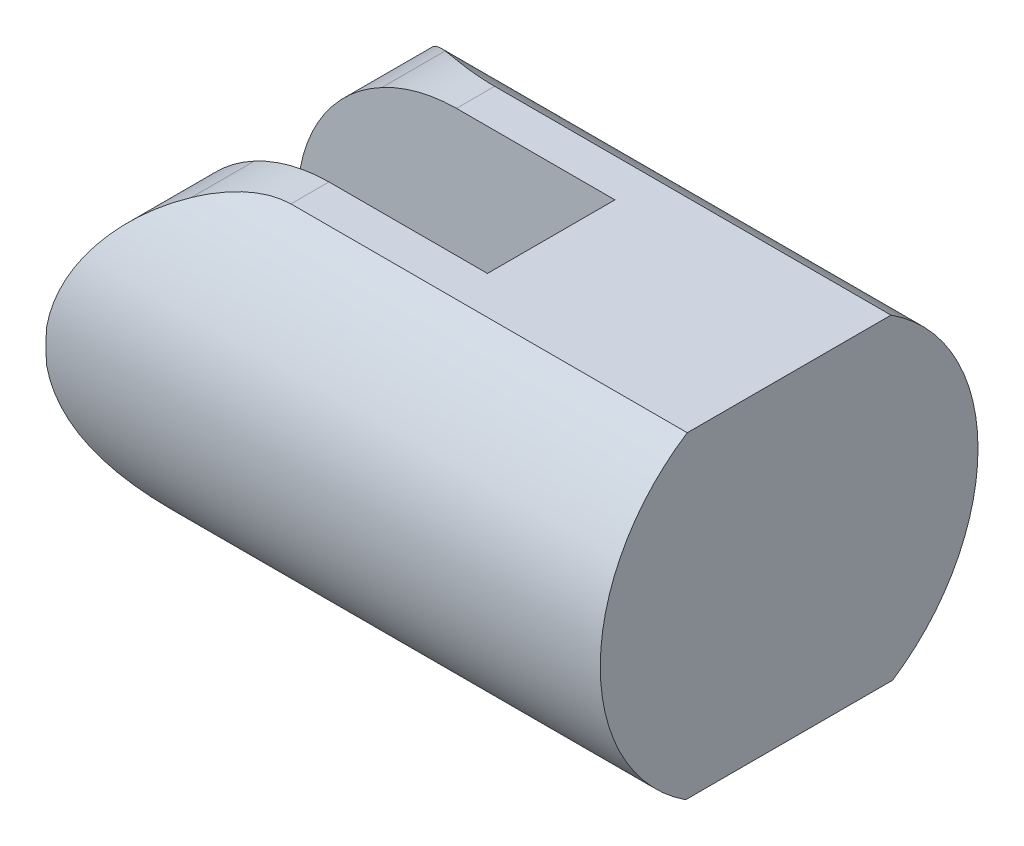
ISO-10303-21;
HEADER;
FILE_DESCRIPTION(('STEP AP214'),'2;1');
FILE_NAME('part.step','',(''),(''),'','','');
FILE_SCHEMA(('AUTOMOTIVE_DESIGN { 1 0 10303 214 1 1 1 1 }'));
ENDSEC;
DATA;
#1=APPLICATION_CONTEXT('core data for automotive mechanical design processes');
#2=APPLICATION_PROTOCOL_DEFINITION('international standard','automotive_design',2000,#1);
#3=PRODUCT_CONTEXT('',#1,'mechanical');
#4=PRODUCT('Part','Part','',(#3));
#5=PRODUCT_RELATED_PRODUCT_CATEGORY('part','',(#4));
#6=PRODUCT_DEFINITION_FORMATION('','',#4);
#7=PRODUCT_DEFINITION_CONTEXT('part definition',#1,'design');
#8=PRODUCT_DEFINITION('design','',#6,#7);
#9=PRODUCT_DEFINITION_SHAPE('','',#8);
#10=(LENGTH_UNIT() NAMED_UNIT(*) SI_UNIT(.MILLI.,.METRE.));
#11=(NAMED_UNIT(*) PLANE_ANGLE_UNIT() SI_UNIT($,.RADIAN.));
#12=(NAMED_UNIT(*) SI_UNIT($,.STERADIAN.) SOLID_ANGLE_UNIT());
#13=UNCERTAINTY_MEASURE_WITH_UNIT(LENGTH_MEASURE(1.E-05),#10,'distance_accuracy_value','');
#14=(GEOMETRIC_REPRESENTATION_CONTEXT(3) GLOBAL_UNCERTAINTY_ASSIGNED_CONTEXT((#13)) GLOBAL_UNIT_ASSIGNED_CONTEXT((#10,
#11,#12)) REPRESENTATION_CONTEXT('',''));
#15=CARTESIAN_POINT('',(0.,0.,0.));
#16=DIRECTION('',(0.,0.,1.));
#17=DIRECTION('',(1.,0.,0.));
#18=AXIS2_PLACEMENT_3D('',#15,#16,#17);
#19=CARTESIAN_POINT('',(0.0930544116006446,-0.0116188090929364,14.7465594708103));
#20=DIRECTION('',(0.,0.,-1.));
#21=DIRECTION('',(-1.,0.,0.));
#22=AXIS2_PLACEMENT_3D('',#19,#20,#21);
#23=CYLINDRICAL_SURFACE('',#22,6.74877858371239);
#24=CARTESIAN_POINT('',(0.0930544116006446,-0.0116188090929364,4.05));
#25=DIRECTION('',(0.,0.,-1.));
#26=DIRECTION('',(0.,1.,0.));
#27=AXIS2_PLACEMENT_3D('',#24,#25,#26);
#28=CIRCLE('',#27,6.74877858371239);
#29=CARTESIAN_POINT('',(-3.12643473410177,5.91973027966245,4.05));
#30=VERTEX_POINT('',#29);
#31=CARTESIAN_POINT('',(0.0372112765928689,6.73692873213751,4.05));
#32=VERTEX_POINT('',#31);
#33=EDGE_CURVE('E195',#30,#32,#28,.T.);
#34=ORIENTED_EDGE('',*,*,#33,.T.);
#35=DIRECTION('',(0.,0.,-1.));
#36=VECTOR('',#35,1.);
#37=CARTESIAN_POINT('',(0.0372112765928689,6.73692873213751,14.7465594708103));
#38=LINE('',#37,#36);
#39=CARTESIAN_POINT('',(0.0372112765928689,6.73692873213751,2.4321891508099));
#40=VERTEX_POINT('',#39);
#41=EDGE_CURVE('E189',#32,#40,#38,.T.);
#42=ORIENTED_EDGE('',*,*,#41,.T.);
#43=CARTESIAN_POINT('',(-3.12643473410177,5.91973027966245,1.36540778961343));
#44=CARTESIAN_POINT('',(-3.01173625404458,5.98196573910494,1.43384798147719));
#45=CARTESIAN_POINT('',(-2.89479057246417,6.04115658256861,1.50137291383398));
#46=CARTESIAN_POINT('',(-2.65599679002678,6.1533008335526,1.63340600042129));
#47=CARTESIAN_POINT('',(-2.5341405771972,6.20624330066136,1.69790874740713));
#48=CARTESIAN_POINT('',(-2.28338508099305,6.30637547843294,1.82353162006153));
#49=CARTESIAN_POINT('',(-2.15440096237412,6.35345125522896,1.88457498193271));
#50=CARTESIAN_POINT('',(-1.89133957121623,6.44031157426301,2.0002333528654));
#51=CARTESIAN_POINT('',(-1.75726572684727,6.48010092263414,2.05485259071516));
#52=CARTESIAN_POINT('',(-1.40513841844408,6.57251683121571,2.18459458780125));
#53=CARTESIAN_POINT('',(-1.18305899628412,6.61940032962797,2.25348808829342));
#54=CARTESIAN_POINT('',(-0.842838677740065,6.6729321240463,2.33373688844447));
#55=CARTESIAN_POINT('',(-0.728638713970952,6.68795480975863,2.35659988254136));
#56=CARTESIAN_POINT('',(-0.498269339211,6.71219882939962,2.39375734082101));
#57=CARTESIAN_POINT('',(-0.382101489675829,6.72142456021049,2.4080582987592));
#58=CARTESIAN_POINT('',(-0.215167996199162,6.73030614311556,2.42186297215073));
#59=CARTESIAN_POINT('',(-0.164814867905161,6.7324201048735,2.42515587713018));
#60=CARTESIAN_POINT('',(-0.063912367921854,6.73552311978046,2.42999424689851));
#61=CARTESIAN_POINT('',(-0.0133628133458943,6.73651043309513,2.4315370089961));
#62=CARTESIAN_POINT('',(0.0372112765928687,6.73692873213751,2.4321891508099));
#63=B_SPLINE_CURVE_WITH_KNOTS('',3,(#43,#44,#45,#46,#47,#48,#49,#50,#51,#52,#53,#54,#55,#56,#57,
#58,#59,#60,#61,#62),.UNSPECIFIED.,.F.,.F.,(4,2,2,2,2,2,2,2,2,4),(0.,0.442063007211571,
0.884888895978977,1.33529183926799,1.78539661789606,2.49388875745279,2.84580831552282,
3.19746062593673,3.34893988182683,3.50065274534146),.UNSPECIFIED.);
#64=CARTESIAN_POINT('',(-3.12643473410177,5.91973027966245,1.36540778961343));
#65=VERTEX_POINT('',#64);
#66=EDGE_CURVE('E199',#65,#40,#63,.T.);
#67=ORIENTED_EDGE('',*,*,#66,.F.);
#68=DIRECTION('',(0.,0.,-1.));
#69=VECTOR('',#68,1.);
#70=CARTESIAN_POINT('',(-3.12643473410177,5.91973027966245,14.7465594708103));
#71=LINE('',#70,#69);
#72=EDGE_CURVE('E177',#30,#65,#71,.T.);
#73=ORIENTED_EDGE('',*,*,#72,.F.);
#74=EDGE_LOOP('',(#34,#42,#67,#73));
#75=FACE_BOUND('',#74,.T.);
#76=ADVANCED_FACE('F36',(#75),#23,.T.);
#77=CARTESIAN_POINT('',(6.75,0.,0.));
#78=DIRECTION('',(1.,0.,0.));
#79=DIRECTION('',(0.,0.,-1.));
#80=AXIS2_PLACEMENT_3D('',#77,#78,#79);
#81=PLANE('',#80);
#82=DIRECTION('',(0.,1.,0.));
#83=VECTOR('',#82,1.);
#84=CARTESIAN_POINT('',(6.75,7.,9.45));
#85=LINE('',#84,#83);
#86=CARTESIAN_POINT('',(6.75,-6.69296612401056,9.45));
#87=VERTEX_POINT('',#86);
#88=CARTESIAN_POINT('',(6.75,6.73692873213751,9.45));
#89=VERTEX_POINT('',#88);
#90=EDGE_CURVE('E59',#87,#89,#85,.T.);
#91=ORIENTED_EDGE('',*,*,#90,.T.);
#92=DIRECTION('',(0.,0.,-1.));
#93=VECTOR('',#92,1.);
#94=CARTESIAN_POINT('',(6.75,6.73692873213751,14.7465594708103));
#95=LINE('',#94,#93);
#96=CARTESIAN_POINT('',(6.75,6.73692873213751,4.05));
#97=VERTEX_POINT('',#96);
#98=EDGE_CURVE('E168',#89,#97,#95,.T.);
#99=ORIENTED_EDGE('',*,*,#98,.T.);
#100=DIRECTION('',(0.,-1.,0.));
#101=VECTOR('',#100,1.);
#102=CARTESIAN_POINT('',(6.75,7.,4.05));
#103=LINE('',#102,#101);
#104=CARTESIAN_POINT('',(6.75,-6.69296612401056,4.05));
#105=VERTEX_POINT('',#104);
#106=EDGE_CURVE('E153',#97,#105,#103,.T.);
#107=ORIENTED_EDGE('',*,*,#106,.T.);
#108=DIRECTION('',(0.,0.,1.));
#109=VECTOR('',#108,1.);
#110=CARTESIAN_POINT('',(6.75,-6.69296612401056,4.05));
#111=LINE('',#110,#109);
#112=EDGE_CURVE('E156',#105,#87,#111,.T.);
#113=ORIENTED_EDGE('',*,*,#112,.T.);
#114=EDGE_LOOP('',(#91,#99,#107,#113));
#115=FACE_BOUND('',#114,.T.);
#116=ADVANCED_FACE('F157',(#115),#81,.F.);
#117=CARTESIAN_POINT('',(6.75,7.,4.05));
#118=DIRECTION('',(0.,0.,-1.));
#119=DIRECTION('',(0.,1.,0.));
#120=AXIS2_PLACEMENT_3D('',#117,#118,#119);
#121=PLANE('',#120);
#122=ORIENTED_EDGE('',*,*,#33,.F.);
#123=CARTESIAN_POINT('',(0.,0.,4.05));
#124=DIRECTION('',(0.,0.,-1.));
#125=DIRECTION('',(0.,1.,0.));
#126=AXIS2_PLACEMENT_3D('',#123,#124,#125);
#127=CIRCLE('',#126,6.69460982661055);
#128=CARTESIAN_POINT('',(-6.65694558839936,0.709137619676756,4.05));
#129=VERTEX_POINT('',#128);
#130=EDGE_CURVE('E253',#129,#30,#127,.T.);
#131=ORIENTED_EDGE('',*,*,#130,.F.);
#132=DIRECTION('',(0.,1.,0.));
#133=VECTOR('',#132,1.);
#134=CARTESIAN_POINT('',(-6.65694558839939,6.99999999999993,4.05));
#135=LINE('',#134,#133);
#136=CARTESIAN_POINT('',(-6.65694558839935,-0.70913761967685,4.05));
#137=VERTEX_POINT('',#136);
#138=EDGE_CURVE('E257',#137,#129,#135,.T.);
#139=ORIENTED_EDGE('',*,*,#138,.F.);
#140=CARTESIAN_POINT('',(0.,0.,4.05));
#141=DIRECTION('',(0.,0.,-1.));
#142=DIRECTION('',(0.,1.,0.));
#143=AXIS2_PLACEMENT_3D('',#140,#141,#142);
#144=CIRCLE('',#143,6.69460982661055);
#145=CARTESIAN_POINT('',(-0.148341475648356,-6.69296612401056,4.05));
#146=VERTEX_POINT('',#145);
#147=EDGE_CURVE('E51',#146,#137,#144,.T.);
#148=ORIENTED_EDGE('',*,*,#147,.F.);
#149=DIRECTION('',(1.,0.,0.));
#150=VECTOR('',#149,1.);
#151=CARTESIAN_POINT('',(6.75,-6.69296612401056,4.05));
#152=LINE('',#151,#150);
#153=CARTESIAN_POINT('',(0.148341475648319,-6.69296612401056,4.05));
#154=VERTEX_POINT('',#153);
#155=EDGE_CURVE('E162',#146,#154,#152,.T.);
#156=ORIENTED_EDGE('',*,*,#155,.T.);
#157=DIRECTION('',(1.,0.,0.));
#158=VECTOR('',#157,1.);
#159=CARTESIAN_POINT('',(18.7538186680354,-6.69296612401056,4.05));
#160=LINE('',#159,#158);
#161=EDGE_CURVE('E44',#154,#105,#160,.T.);
#162=ORIENTED_EDGE('',*,*,#161,.T.);
#163=ORIENTED_EDGE('',*,*,#106,.F.);
#164=DIRECTION('',(-1.,0.,0.));
#165=VECTOR('',#164,1.);
#166=CARTESIAN_POINT('',(0.0372112765928689,6.73692873213751,4.05));
#167=LINE('',#166,#165);
#168=EDGE_CURVE('E174',#97,#32,#167,.T.);
#169=ORIENTED_EDGE('',*,*,#168,.T.);
#170=EDGE_LOOP('',(#122,#131,#139,#148,#156,#162,#163,#169));
#171=FACE_BOUND('',#170,.T.);
#172=ADVANCED_FACE('F305',(#171),#121,.F.);
#173=CARTESIAN_POINT('',(6.75,7.,9.45));
#174=DIRECTION('',(0.,0.,1.));
#175=DIRECTION('',(1.,0.,0.));
#176=AXIS2_PLACEMENT_3D('',#173,#174,#175);
#177=PLANE('',#176);
#178=CARTESIAN_POINT('',(0.0930544116006446,-0.0116188090929364,9.45));
#179=DIRECTION('',(0.,0.,1.));
#180=DIRECTION('',(1.,0.,0.));
#181=AXIS2_PLACEMENT_3D('',#178,#179,#180);
#182=CIRCLE('',#181,6.74877858371239);
#183=CARTESIAN_POINT('',(0.0372112765928689,6.73692873213751,9.45));
#184=VERTEX_POINT('',#183);
#185=CARTESIAN_POINT('',(-3.12643473410177,5.91973027966245,9.45));
#186=VERTEX_POINT('',#185);
#187=EDGE_CURVE('E197',#184,#186,#182,.T.);
#188=ORIENTED_EDGE('',*,*,#187,.F.);
#189=DIRECTION('',(1.,0.,0.));
#190=VECTOR('',#189,1.);
#191=CARTESIAN_POINT('',(0.0372112765928689,6.73692873213751,9.45));
#192=LINE('',#191,#190);
#193=EDGE_CURVE('E150',#184,#89,#192,.T.);
#194=ORIENTED_EDGE('',*,*,#193,.T.);
#195=ORIENTED_EDGE('',*,*,#90,.F.);
#196=DIRECTION('',(-1.,0.,0.));
#197=VECTOR('',#196,1.);
#198=CARTESIAN_POINT('',(-8.96539609126989,-6.69296612401056,9.45));
#199=LINE('',#198,#197);
#200=CARTESIAN_POINT('',(0.148341475648319,-6.69296612401056,9.45));
#201=VERTEX_POINT('',#200);
#202=EDGE_CURVE('E147',#87,#201,#199,.T.);
#203=ORIENTED_EDGE('',*,*,#202,.T.);
#204=CARTESIAN_POINT('',(-0.148341475648356,-6.69296612401056,9.45));
#205=VERTEX_POINT('',#204);
#206=EDGE_CURVE('E161',#201,#205,#199,.T.);
#207=ORIENTED_EDGE('',*,*,#206,.T.);
#208=CARTESIAN_POINT('',(0.,0.,9.45));
#209=DIRECTION('',(0.,0.,1.));
#210=DIRECTION('',(1.,0.,0.));
#211=AXIS2_PLACEMENT_3D('',#208,#209,#210);
#212=CIRCLE('',#211,6.69460982661055);
#213=CARTESIAN_POINT('',(-6.65694558839935,-0.70913761967685,9.45));
#214=VERTEX_POINT('',#213);
#215=EDGE_CURVE('E313',#214,#205,#212,.T.);
#216=ORIENTED_EDGE('',*,*,#215,.F.);
#217=DIRECTION('',(0.,-1.,0.));
#218=VECTOR('',#217,1.);
#219=CARTESIAN_POINT('',(-6.65694558839939,6.99999999999993,9.45));
#220=LINE('',#219,#218);
#221=CARTESIAN_POINT('',(-6.65694558839936,0.709137619676756,9.45));
#222=VERTEX_POINT('',#221);
#223=EDGE_CURVE('E259',#222,#214,#220,.T.);
#224=ORIENTED_EDGE('',*,*,#223,.F.);
#225=CARTESIAN_POINT('',(0.,0.,9.45));
#226=DIRECTION('',(0.,0.,1.));
#227=DIRECTION('',(1.,0.,0.));
#228=AXIS2_PLACEMENT_3D('',#225,#226,#227);
#229=CIRCLE('',#228,6.69460982661055);
#230=EDGE_CURVE('E255',#186,#222,#229,.T.);
#231=ORIENTED_EDGE('',*,*,#230,.F.);
#232=EDGE_LOOP('',(#188,#194,#195,#203,#207,#216,#224,#231));
#233=FACE_BOUND('',#232,.T.);
#234=ADVANCED_FACE('F144',(#233),#177,.F.);
#235=CARTESIAN_POINT('',(-6.65694558839935,-0.70913761967685,14.7465594708103));
#236=DIRECTION('',(-1.,0.,0.));
#237=DIRECTION('',(0.,-1.,0.));
#238=AXIS2_PLACEMENT_3D('',#235,#236,#237);
#239=PLANE('',#238);
#240=ORIENTED_EDGE('',*,*,#223,.T.);
#241=DIRECTION('',(0.,0.,-1.));
#242=VECTOR('',#241,1.);
#243=CARTESIAN_POINT('',(-6.65694558839935,-0.70913761967685,14.7465594708103));
#244=LINE('',#243,#242);
#245=CARTESIAN_POINT('',(-6.65694558839935,-0.70913761967685,14.715067727464));
#246=VERTEX_POINT('',#245);
#247=EDGE_CURVE('E187',#246,#214,#244,.T.);
#248=ORIENTED_EDGE('',*,*,#247,.F.);
#249=CARTESIAN_POINT('',(-6.65694558839935,0.,6.74655947081026));
#250=DIRECTION('',(-1.,0.,0.));
#251=DIRECTION('',(0.,-1.,0.));
#252=AXIS2_PLACEMENT_3D('',#249,#250,#251);
#253=CIRCLE('',#252,8.);
#254=CARTESIAN_POINT('',(-6.65694558839936,0.709137619676756,14.715067727464));
#255=VERTEX_POINT('',#254);
#256=EDGE_CURVE('E152',#255,#246,#253,.F.);
#257=ORIENTED_EDGE('',*,*,#256,.F.);
#258=DIRECTION('',(0.,0.,-1.));
#259=VECTOR('',#258,1.);
#260=CARTESIAN_POINT('',(-6.65694558839936,0.709137619676756,14.7465594708103));
#261=LINE('',#260,#259);
#262=EDGE_CURVE('E183',#255,#222,#261,.T.);
#263=ORIENTED_EDGE('',*,*,#262,.T.);
#264=EDGE_LOOP('',(#240,#248,#257,#263));
#265=FACE_BOUND('',#264,.T.);
#266=ADVANCED_FACE('F235',(#265),#239,.T.);
#267=ORIENTED_EDGE('',*,*,#138,.T.);
#268=CARTESIAN_POINT('',(-6.65694558839936,0.709137619676756,-1.2219487858435));
#269=VERTEX_POINT('',#268);
#270=EDGE_CURVE('E180',#129,#269,#261,.T.);
#271=ORIENTED_EDGE('',*,*,#270,.T.);
#272=CARTESIAN_POINT('',(-6.65694558839935,-0.70913761967685,-1.22194878584349));
#273=VERTEX_POINT('',#272);
#274=EDGE_CURVE('E273',#273,#269,#253,.F.);
#275=ORIENTED_EDGE('',*,*,#274,.F.);
#276=EDGE_CURVE('E184',#137,#273,#244,.T.);
#277=ORIENTED_EDGE('',*,*,#276,.F.);
#278=EDGE_LOOP('',(#267,#271,#275,#277));
#279=FACE_BOUND('',#278,.T.);
#280=ADVANCED_FACE('F289',(#279),#239,.T.);
#281=CARTESIAN_POINT('',(0.,0.,14.7465594708103));
#282=DIRECTION('',(0.,0.,-1.));
#283=DIRECTION('',(-1.,0.,0.));
#284=AXIS2_PLACEMENT_3D('',#281,#282,#283);
#285=CYLINDRICAL_SURFACE('',#284,6.69460982661055);
#286=ORIENTED_EDGE('',*,*,#230,.T.);
#287=ORIENTED_EDGE('',*,*,#262,.F.);
#288=CARTESIAN_POINT('',(-3.12643473410177,5.91973027966245,12.1277111520071));
#289=CARTESIAN_POINT('',(-3.21776408803291,5.87148927024248,12.1807845813667));
#290=CARTESIAN_POINT('',(-3.30765371018943,5.82131870422187,12.234538127654));
#291=CARTESIAN_POINT('',(-3.48460919031115,5.71715466157955,12.3429676890738));
#292=CARTESIAN_POINT('',(-3.57167522401935,5.66316142355323,12.3976436464712));
#293=CARTESIAN_POINT('',(-3.82881947137856,5.4954396604175,12.5624606986961));
#294=CARTESIAN_POINT('',(-3.99475742641467,5.37601484774225,12.6733398723134));
#295=CARTESIAN_POINT('',(-4.31731490798811,5.1206828273623,12.8953470649783));
#296=CARTESIAN_POINT('',(-4.47380296543399,4.98459940560542,13.0064628655228));
#297=CARTESIAN_POINT('',(-4.77477218819663,4.69708746014294,13.2249816898586));
#298=CARTESIAN_POINT('',(-4.91925733256579,4.5456640589956,13.3323859371054));
#299=CARTESIAN_POINT('',(-5.16861846491586,4.25817695104675,13.520887317053));
#300=CARTESIAN_POINT('',(-5.27576012552819,4.12478110006743,13.6030638659026));
#301=CARTESIAN_POINT('',(-5.48084668288199,3.84808619426256,13.7620912315863));
#302=CARTESIAN_POINT('',(-5.57879223096534,3.7047878420609,13.8389424255031));
#303=CARTESIAN_POINT('',(-5.76393680105031,3.40954294282816,13.9854813688424));
#304=CARTESIAN_POINT('',(-5.85120526155753,3.25766283498245,14.0552148550972));
#305=CARTESIAN_POINT('',(-6.01474075886347,2.94479860900571,14.1867844520859));
#306=CARTESIAN_POINT('',(-6.09100851503117,2.78381508713339,14.2486210791888));
#307=CARTESIAN_POINT('',(-6.22373678463603,2.47152849678747,14.3568017510857));
#308=CARTESIAN_POINT('',(-6.2814509719123,2.32108952036685,14.4041003252004));
#309=CARTESIAN_POINT('',(-6.3864295139683,2.01434666520172,14.4904468969866));
#310=CARTESIAN_POINT('',(-6.43369727922727,1.85804472011189,14.529497587188));
#311=CARTESIAN_POINT('',(-6.51753518204106,1.53853939286449,14.5989409545719));
#312=CARTESIAN_POINT('',(-6.55396625787819,1.37527468510471,14.6292209627859));
#313=CARTESIAN_POINT('',(-6.61472623764133,1.04479582181669,14.6798158848734));
#314=CARTESIAN_POINT('',(-6.63904063239759,0.877577181289918,14.7001188512948));
#315=CARTESIAN_POINT('',(-6.65694558839936,0.709137619676756,14.715067727464));
#316=B_SPLINE_CURVE_WITH_KNOTS('',3,(#288,#289,#290,#291,#292,#293,#294,#295,#296,#297,#298,
#299,#300,#301,#302,#303,#304,#305,#306,#307,#308,#309,#310,#311,#312,#313,#314,#315),
.UNSPECIFIED.,.F.,.F.,(4,2,2,2,2,2,2,2,2,2,2,2,2,4),(0.,0.348312517813112,0.696603314532694,
1.39351487760636,2.09856595536206,2.80338236305498,3.37230167547179,3.94118066204951,
4.50613737090215,5.07105711877908,5.57425378508696,6.07728592757482,6.58651934973679,
7.09636109903309),.UNSPECIFIED.);
#317=CARTESIAN_POINT('',(-3.12643473410177,5.91973027966245,12.1277111520071));
#318=VERTEX_POINT('',#317);
#319=EDGE_CURVE('E294',#318,#255,#316,.T.);
#320=ORIENTED_EDGE('',*,*,#319,.F.);
#321=EDGE_CURVE('E179',#318,#186,#71,.T.);
#322=ORIENTED_EDGE('',*,*,#321,.T.);
#323=EDGE_LOOP('',(#286,#287,#320,#322));
#324=FACE_BOUND('',#323,.T.);
#325=ADVANCED_FACE('F285',(#324),#285,.T.);
#326=ORIENTED_EDGE('',*,*,#130,.T.);
#327=ORIENTED_EDGE('',*,*,#72,.T.);
#328=CARTESIAN_POINT('',(-6.65694558839936,0.709137619676756,-1.2219487858435));
#329=CARTESIAN_POINT('',(-6.63907358582287,0.877266730488714,-1.20702738111848));
#330=CARTESIAN_POINT('',(-6.61481565160211,1.04418022309345,-1.18677157539682));
#331=CARTESIAN_POINT('',(-6.55420956060743,1.37407911601935,-1.13630441735877));
#332=CARTESIAN_POINT('',(-6.51787485914864,1.53706867241552,-1.1061041450042));
#333=CARTESIAN_POINT('',(-6.43426841386044,1.85604059943133,-1.0368509761032));
#334=CARTESIAN_POINT('',(-6.38713578721555,2.01208426930274,-0.997910801411884));
#335=CARTESIAN_POINT('',(-6.28246299801871,2.31832789851076,-0.911811892716257));
#336=CARTESIAN_POINT('',(-6.22492028311377,2.46852641372978,-0.864651143289183));
#337=CARTESIAN_POINT('',(-6.10052618440696,2.76163350311869,-0.763255927525403));
#338=CARTESIAN_POINT('',(-6.03371829520476,2.90457210623399,-0.709054583935849));
#339=CARTESIAN_POINT('',(-5.89138916950459,3.18336801149152,-0.594345832832598));
#340=CARTESIAN_POINT('',(-5.81586857058918,3.31922583073957,-0.53383888678438));
#341=CARTESIAN_POINT('',(-5.65633896559386,3.58437164660545,-0.407041711304105));
#342=CARTESIAN_POINT('',(-5.57227964976373,3.71361304761486,-0.340717561831478));
#343=CARTESIAN_POINT('',(-5.39672872548968,3.96441131989942,-0.20354009678589));
#344=CARTESIAN_POINT('',(-5.30523603959694,4.08596707260166,-0.132686124944566));
#345=CARTESIAN_POINT('',(-5.06484377159455,4.3839281450669,0.0513337494082804));
#346=CARTESIAN_POINT('',(-4.91130104018515,4.55510521621983,0.166953993912126));
#347=CARTESIAN_POINT('',(-4.58954470654147,4.87914796541331,0.403515569391595));
#348=CARTESIAN_POINT('',(-4.42132075028678,5.03200053668483,0.524460625443275));
#349=CARTESIAN_POINT('',(-4.0728668393798,5.31787798421787,0.767018297145268));
#350=CARTESIAN_POINT('',(-3.8927762498073,5.4510885522871,0.888611641890546));
#351=CARTESIAN_POINT('',(-3.61282163455196,5.63718485478972,1.06944475743953));
#352=CARTESIAN_POINT('',(-3.51791773136068,5.69690347448203,1.12943286592399));
#353=CARTESIAN_POINT('',(-3.32472954714686,5.81176200620635,1.24835347281292));
#354=CARTESIAN_POINT('',(-3.22644506192729,5.86690164096499,1.30728590712345));
#355=CARTESIAN_POINT('',(-3.12643473410177,5.91973027966245,1.36540778961343));
#356=B_SPLINE_CURVE_WITH_KNOTS('',3,(#328,#329,#330,#331,#332,#333,#334,#335,#336,#337,#338,
#339,#340,#341,#342,#343,#344,#345,#346,#347,#348,#349,#350,#351,#352,#353,#354,#355),
.UNSPECIFIED.,.F.,.F.,(4,2,2,2,2,2,2,2,2,2,2,2,2,4),(0.,0.508904533094786,1.01724396090128,
1.51936973026676,2.02161877845259,2.52158520493002,3.02151506782095,3.52458322815876,
4.02772443753627,4.7985706958077,5.56996506045491,6.33352110228599,6.71491139209401,
7.09632475958638),.UNSPECIFIED.);
#357=EDGE_CURVE('E276',#269,#65,#356,.T.);
#358=ORIENTED_EDGE('',*,*,#357,.F.);
#359=ORIENTED_EDGE('',*,*,#270,.F.);
#360=EDGE_LOOP('',(#326,#327,#358,#359));
#361=FACE_BOUND('',#360,.T.);
#362=ADVANCED_FACE('F233',(#361),#285,.T.);
#363=CARTESIAN_POINT('',(0.,0.,14.7465594708103));
#364=DIRECTION('',(0.,0.,-1.));
#365=DIRECTION('',(-1.,0.,0.));
#366=AXIS2_PLACEMENT_3D('',#363,#364,#365);
#367=CYLINDRICAL_SURFACE('',#366,6.69460982661055);
#368=DIRECTION('',(0.,0.,-1.));
#369=VECTOR('',#368,1.);
#370=CARTESIAN_POINT('',(-0.148341475648356,-6.69296612401056,14.7465594708103));
#371=LINE('',#370,#369);
#372=EDGE_CURVE('E11',#205,#146,#371,.T.);
#373=ORIENTED_EDGE('',*,*,#372,.T.);
#374=ORIENTED_EDGE('',*,*,#147,.T.);
#375=ORIENTED_EDGE('',*,*,#276,.T.);
#376=CARTESIAN_POINT('',(0.148341475648321,-6.69296612401056,2.36429927054294));
#377=CARTESIAN_POINT('',(0.0336698559870904,-6.6955348651247,2.36826363075334));
#378=CARTESIAN_POINT('',(-0.0811947210679713,-6.69510620725473,2.36757612611348));
#379=CARTESIAN_POINT('',(-0.310174084658231,-6.6883923537031,2.35730662101784));
#380=CARTESIAN_POINT('',(-0.424289779188243,-6.68211656617413,2.34773890909375));
#381=CARTESIAN_POINT('',(-0.649321788211253,-6.66399009717774,2.32033397655652));
#382=CARTESIAN_POINT('',(-0.760260439871377,-6.65222383958478,2.30262204329248));
#383=CARTESIAN_POINT('',(-0.980028090809842,-6.62341545778803,2.25979696777549));
#384=CARTESIAN_POINT('',(-1.08885612979303,-6.60637098927134,2.23468053705971));
#385=CARTESIAN_POINT('',(-1.34252628459086,-6.56029609449376,2.16783737318293));
#386=CARTESIAN_POINT('',(-1.48626843432623,-6.52915943650235,2.12338467881009));
#387=CARTESIAN_POINT('',(-1.76837046553117,-6.45847039250704,2.0251384216724));
#388=CARTESIAN_POINT('',(-1.90672814319111,-6.41891460260927,1.9713410824472));
#389=CARTESIAN_POINT('',(-2.17894343631396,-6.33171251039673,1.85629760978527));
#390=CARTESIAN_POINT('',(-2.31276045959249,-6.2840088311143,1.79499959088331));
#391=CARTESIAN_POINT('',(-2.57498387658405,-6.18118905058895,1.66722498459812));
#392=CARTESIAN_POINT('',(-2.70338831051548,-6.12607029427506,1.6007465458979));
#393=CARTESIAN_POINT('',(-3.02117115574183,-5.97789504558838,1.42832753165929));
#394=CARTESIAN_POINT('',(-3.20708859935268,-5.8801351955218,1.32002567940129));
#395=CARTESIAN_POINT('',(-3.5673738877864,-5.66879812891621,1.09960514350255));
#396=CARTESIAN_POINT('',(-3.74173587378245,-5.55521297784223,0.987484566657759));
#397=CARTESIAN_POINT('',(-4.07876652601614,-5.31267298315954,0.763017342365048));
#398=CARTESIAN_POINT('',(-4.24145199631407,-5.18374096673008,0.650671269107772));
#399=CARTESIAN_POINT('',(-4.55505205625638,-4.91045139270547,0.428452319892197));
#400=CARTESIAN_POINT('',(-4.70597076940684,-4.76609928129327,0.318578587224192));
#401=CARTESIAN_POINT('',(-4.97090952873932,-4.48757267728096,0.121933933082548));
#402=CARTESIAN_POINT('',(-5.08686266286339,-4.3557801263935,0.0343891674659877));
#403=CARTESIAN_POINT('',(-5.30940732688984,-4.08156384110504,-0.135799521758634));
#404=CARTESIAN_POINT('',(-5.41600059949084,-3.93914209491219,-0.218444356742772));
#405=CARTESIAN_POINT('',(-5.61886686965236,-3.6439247569872,-0.377336485935437));
#406=CARTESIAN_POINT('',(-5.71514742374589,-3.4911368968741,-0.45358845542124));
#407=CARTESIAN_POINT('',(-5.89637781056094,-3.17547278615556,-0.59826820775739));
#408=CARTESIAN_POINT('',(-5.98133058404982,-3.01259917002138,-0.666698020630701));
#409=CARTESIAN_POINT('',(-6.1237862003524,-2.7091643067286,-0.782156523531878));
#410=CARTESIAN_POINT('',(-6.18344075580083,-2.57021848975478,-0.83078399283458));
#411=CARTESIAN_POINT('',(-6.2938167949713,-2.28665776352076,-0.921120944389605));
#412=CARTESIAN_POINT('',(-6.34454033922276,-2.14204417134659,-0.962832022236146));
#413=CARTESIAN_POINT('',(-6.43628128096321,-1.84816907352506,-1.03850605665312));
#414=CARTESIAN_POINT('',(-6.47732023823702,-1.69891874534712,-1.07248621757955));
#415=CARTESIAN_POINT('',(-6.54919523912185,-1.39641604646445,-1.13213042785529));
#416=CARTESIAN_POINT('',(-6.58003787844454,-1.24316633235596,-1.15779985296318));
#417=CARTESIAN_POINT('',(-6.61588032243203,-1.02566478304824,-1.18767270451897));
#418=CARTESIAN_POINT('',(-6.62534884334686,-0.962616207965888,-1.19557022651387));
#419=CARTESIAN_POINT('',(-6.64249384802957,-0.836148157767012,-1.20987827553163));
#420=CARTESIAN_POINT('',(-6.65017143118207,-0.772728934817953,-1.21628971478545));
#421=CARTESIAN_POINT('',(-6.65694558839935,-0.709137619676852,-1.22194878584349));
#422=B_SPLINE_CURVE_WITH_KNOTS('',3,(#376,#377,#378,#379,#380,#381,#382,#383,#384,#385,#386,
#387,#388,#389,#390,#391,#392,#393,#394,#395,#396,#397,#398,#399,#400,#401,#402,#403,#404,#405,
#406,#407,#408,#409,#410,#411,#412,#413,#414,#415,#416,#417,#418,#419,#420,#421),.UNSPECIFIED.,
.F.,.F.,(4,2,2,2,2,2,2,2,2,2,2,2,2,2,2,2,2,2,2,2,2,2,4),(0.,0.344125100419054,0.687697450902055,
1.02615268020831,1.36475845024548,1.824949032707,2.28532602697408,2.74908977215007,
3.21302001854164,3.92102047915633,4.62937720515083,5.33669317519491,6.04376015099599,
6.63171595191369,7.21956204906805,7.80697441844893,8.39423399352547,8.87028551667136,
9.34622706266305,9.82109885784119,10.2956628679726,10.4883563364022,10.680931204944),.UNSPECIFIED.);
#423=CARTESIAN_POINT('',(0.148341475648318,-6.69296612401056,2.36429927054294));
#424=VERTEX_POINT('',#423);
#425=EDGE_CURVE('E239',#424,#273,#422,.T.);
#426=ORIENTED_EDGE('',*,*,#425,.F.);
#427=DIRECTION('',(0.,0.,-1.));
#428=VECTOR('',#427,1.);
#429=CARTESIAN_POINT('',(0.148341475648318,-6.69296612401056,14.7465594708103));
#430=LINE('',#429,#428);
#431=EDGE_CURVE('E191',#154,#424,#430,.T.);
#432=ORIENTED_EDGE('',*,*,#431,.F.);
#433=EDGE_CURVE('E190',#201,#154,#430,.T.);
#434=ORIENTED_EDGE('',*,*,#433,.F.);
#435=CARTESIAN_POINT('',(0.148341475648318,-6.69296612401056,11.1288196710776));
#436=VERTEX_POINT('',#435);
#437=EDGE_CURVE('E167',#436,#201,#430,.T.);
#438=ORIENTED_EDGE('',*,*,#437,.F.);
#439=CARTESIAN_POINT('',(-6.65694558839935,-0.709137619676852,14.715067727464));
#440=CARTESIAN_POINT('',(-6.63910069606829,-0.876999719448894,14.7001688122202));
#441=CARTESIAN_POINT('',(-6.61489248772448,-1.04364706424472,14.6799545959956));
#442=CARTESIAN_POINT('',(-6.55442319182911,-1.37302994850417,14.6296011322925));
#443=CARTESIAN_POINT('',(-6.51817538039215,-1.53576958598808,14.5994728174654));
#444=CARTESIAN_POINT('',(-6.43463856268134,-1.85477837412021,14.5302757454462));
#445=CARTESIAN_POINT('',(-6.38745252089319,-2.01109277584813,14.491290425948));
#446=CARTESIAN_POINT('',(-6.28265318952355,-2.31783598559989,14.4050871252341));
#447=CARTESIAN_POINT('',(-6.22503734882743,-2.46826334268812,14.3578671299317));
#448=CARTESIAN_POINT('',(-6.03831474153326,-2.9081955580844,14.205662299146));
#449=CARTESIAN_POINT('',(-5.89488750566792,-3.18800451188964,14.0897590632111));
#450=CARTESIAN_POINT('',(-5.57565805037595,-3.71835413818191,13.8360384977508));
#451=CARTESIAN_POINT('',(-5.39976309127477,-3.96880752222103,13.6981585527418));
#452=CARTESIAN_POINT('',(-5.07743916786106,-4.36831311985966,13.4514317234038));
#453=CARTESIAN_POINT('',(-4.93790829765371,-4.52530419923316,13.3462187364788));
#454=CARTESIAN_POINT('',(-4.64650550303603,-4.82403882752097,13.1311131178161));
#455=CARTESIAN_POINT('',(-4.49462839577834,-4.96577591430833,13.0212185300913));
#456=CARTESIAN_POINT('',(-4.17917721489214,-5.23404267314168,12.7992562032785));
#457=CARTESIAN_POINT('',(-4.01559194385956,-5.36055746844525,12.6871864606224));
#458=CARTESIAN_POINT('',(-3.67713714089534,-5.59814328297952,12.4638430099713));
#459=CARTESIAN_POINT('',(-3.50227192550375,-5.70922015916703,12.3525690153608));
#460=CARTESIAN_POINT('',(-3.19321413604265,-5.88583465678983,12.1658195980184));
#461=CARTESIAN_POINT('',(-3.06186619895136,-5.95525768969201,12.0892893238663));
#462=CARTESIAN_POINT('',(-2.79310254293996,-6.08594424182363,11.9399321252097));
#463=CARTESIAN_POINT('',(-2.6556865084811,-6.14720733607252,11.8671053937125));
#464=CARTESIAN_POINT('',(-2.37482044570284,-6.26106421487177,11.7272410552202));
#465=CARTESIAN_POINT('',(-2.23138382161706,-6.31367609610869,11.6601915070961));
#466=CARTESIAN_POINT('',(-1.93814835764628,-6.40977486261655,11.5341539400697));
#467=CARTESIAN_POINT('',(-1.78835259087316,-6.45326609649727,11.475162084061));
#468=CARTESIAN_POINT('',(-1.42329890387198,-6.54519872521227,11.3475107558866));
#469=CARTESIAN_POINT('',(-1.20500242727259,-6.58912184290775,11.2838452578027));
#470=CARTESIAN_POINT('',(-0.870684057326194,-6.6387052443681,11.2106889115038));
#471=CARTESIAN_POINT('',(-0.758227451773388,-6.65250985794687,11.1900376771345));
#472=CARTESIAN_POINT('',(-0.531574550643502,-6.67444079671031,11.1570287608542));
#473=CARTESIAN_POINT('',(-0.417379344274426,-6.68257053872379,11.1446660885941));
#474=CARTESIAN_POINT('',(-0.227794099226075,-6.69115453480967,11.1315894979878));
#475=CARTESIAN_POINT('',(-0.152643783460379,-6.69329100868746,11.128325480942));
#476=CARTESIAN_POINT('',(-0.00218781311296181,-6.69503338685797,11.1256592772487));
#477=CARTESIAN_POINT('',(0.0731179165767145,-6.69463733790177,11.126260071401));
#478=CARTESIAN_POINT('',(0.148341475648321,-6.69296612401056,11.1288196710776));
#479=B_SPLINE_CURVE_WITH_KNOTS('',3,(#439,#440,#441,#442,#443,#444,#445,#446,#447,#448,#449,
#450,#451,#452,#453,#454,#455,#456,#457,#458,#459,#460,#461,#462,#463,#464,#465,#466,#467,#468,
#469,#470,#471,#472,#473,#474,#475,#476,#477,#478),.UNSPECIFIED.,.F.,.F.,(4,2,2,2,2,2,2,2,2,2,2,
2,2,2,2,2,2,2,2,4),(0.,0.508090937674401,1.01562345144214,1.51855963357263,2.0216189998396,
3.02254479197983,4.02637512351876,4.73028247490121,5.43448686198223,6.13937397207147,
6.84399292236209,7.34504569695064,7.84612455684439,8.34614154123066,8.84591957906379,
9.5377194242833,9.88285497021724,10.2277825310677,10.4534053275167,10.6792021601499),.UNSPECIFIED.);
#480=EDGE_CURVE('E246',#246,#436,#479,.T.);
#481=ORIENTED_EDGE('',*,*,#480,.F.);
#482=ORIENTED_EDGE('',*,*,#247,.T.);
#483=ORIENTED_EDGE('',*,*,#215,.T.);
#484=EDGE_LOOP('',(#373,#374,#375,#426,#432,#434,#438,#481,#482,#483));
#485=FACE_BOUND('',#484,.T.);
#486=ADVANCED_FACE('F222',(#485),#367,.T.);
#487=CARTESIAN_POINT('',(0.0372112765928689,6.73692873213751,11.0609297908106));
#488=VERTEX_POINT('',#487);
#489=EDGE_CURVE('E192',#488,#184,#38,.T.);
#490=ORIENTED_EDGE('',*,*,#489,.T.);
#491=ORIENTED_EDGE('',*,*,#187,.T.);
#492=ORIENTED_EDGE('',*,*,#321,.F.);
#493=CARTESIAN_POINT('',(0.0372112765928689,6.73692873213751,11.0609297908106));
#494=CARTESIAN_POINT('',(-0.0827737079089727,6.73596433544957,11.0623913186428));
#495=CARTESIAN_POINT('',(-0.202599664675779,6.73174565321159,11.0690223136708));
#496=CARTESIAN_POINT('',(-0.440723655481792,6.71706528414584,11.0918232027331));
#497=CARTESIAN_POINT('',(-0.55902425631835,6.70661604209413,11.1079740812372));
#498=CARTESIAN_POINT('',(-0.790720598724845,6.68003852536403,11.1485620790141));
#499=CARTESIAN_POINT('',(-0.904166750246901,6.66404416318735,11.1728033439138));
#500=CARTESIAN_POINT('',(-1.12837889418578,6.62668163457817,11.2285481818941));
#501=CARTESIAN_POINT('',(-1.2391437021765,6.60531113918037,11.2600549019085));
#502=CARTESIAN_POINT('',(-1.50738310462955,6.54666639354801,11.3449158090334));
#503=CARTESIAN_POINT('',(-1.66316394913483,6.50658118607172,11.4016859430416));
#504=CARTESIAN_POINT('',(-1.96808429949331,6.41668012558718,11.5248479205405));
#505=CARTESIAN_POINT('',(-2.11721567470296,6.3668527404641,11.5912511427394));
#506=CARTESIAN_POINT('',(-2.41405204229875,6.25627043093016,11.7332852480768));
#507=CARTESIAN_POINT('',(-2.56151633662045,6.19518907511221,11.8091608205501));
#508=CARTESIAN_POINT('',(-2.84919219270745,6.0640684150537,11.9655243922822));
#509=CARTESIAN_POINT('',(-2.98942516431049,5.99405797424401,12.045997087828));
#510=CARTESIAN_POINT('',(-3.12643473410178,5.91973027966251,12.1277111520071));
#511=B_SPLINE_CURVE_WITH_KNOTS('',3,(#493,#494,#495,#496,#497,#498,#499,#500,#501,#502,#503,
#504,#505,#506,#507,#508,#509,#510),.UNSPECIFIED.,.F.,.F.,(4,2,2,2,2,2,2,2,4),(0.,
0.359739318425171,0.718762497544021,1.0696583700028,1.42070651470049,1.9315828772613,
2.44306768169834,2.97280019470865,3.50086179294488),.UNSPECIFIED.);
#512=EDGE_CURVE('E208',#488,#318,#511,.T.);
#513=ORIENTED_EDGE('',*,*,#512,.F.);
#514=EDGE_LOOP('',(#490,#491,#492,#513));
#515=FACE_BOUND('',#514,.T.);
#516=ADVANCED_FACE('F217',(#515),#23,.T.);
#517=CARTESIAN_POINT('',(0.0372112765928689,6.73692873213751,14.7465594708103));
#518=DIRECTION('',(0.,1.,0.));
#519=DIRECTION('',(0.,0.,1.));
#520=AXIS2_PLACEMENT_3D('',#517,#518,#519);
#521=PLANE('',#520);
#522=ORIENTED_EDGE('',*,*,#168,.F.);
#523=ORIENTED_EDGE('',*,*,#98,.F.);
#524=ORIENTED_EDGE('',*,*,#193,.F.);
#525=ORIENTED_EDGE('',*,*,#489,.F.);
#526=DIRECTION('',(1.,0.,0.));
#527=VECTOR('',#526,1.);
#528=CARTESIAN_POINT('',(-6.75,6.73692873213751,11.0609297908106));
#529=LINE('',#528,#527);
#530=CARTESIAN_POINT('',(16.824911634061,6.73692873213751,11.0609297908106));
#531=VERTEX_POINT('',#530);
#532=EDGE_CURVE('E301',#531,#488,#529,.F.);
#533=ORIENTED_EDGE('',*,*,#532,.F.);
#534=DIRECTION('',(0.,0.,-1.));
#535=VECTOR('',#534,1.);
#536=CARTESIAN_POINT('',(16.824911634061,6.73692873213751,13.5));
#537=LINE('',#536,#535);
#538=CARTESIAN_POINT('',(16.824911634061,6.73692873213751,2.4321891508099));
#539=VERTEX_POINT('',#538);
#540=EDGE_CURVE('E263',#531,#539,#537,.T.);
#541=ORIENTED_EDGE('',*,*,#540,.T.);
#542=DIRECTION('',(1.,0.,0.));
#543=VECTOR('',#542,1.);
#544=CARTESIAN_POINT('',(-6.75,6.73692873213751,2.4321891508099));
#545=LINE('',#544,#543);
#546=EDGE_CURVE('E302',#40,#539,#545,.T.);
#547=ORIENTED_EDGE('',*,*,#546,.F.);
#548=ORIENTED_EDGE('',*,*,#41,.F.);
#549=EDGE_LOOP('',(#522,#523,#524,#525,#533,#541,#547,#548));
#550=FACE_BOUND('',#549,.T.);
#551=ADVANCED_FACE('F221',(#550),#521,.T.);
#552=CARTESIAN_POINT('',(18.7538186680354,-6.69296612401056,14.7465594708103));
#553=DIRECTION('',(0.,-1.,0.));
#554=DIRECTION('',(0.,0.,-1.));
#555=AXIS2_PLACEMENT_3D('',#552,#553,#554);
#556=PLANE('',#555);
#557=ORIENTED_EDGE('',*,*,#161,.F.);
#558=ORIENTED_EDGE('',*,*,#431,.T.);
#559=DIRECTION('',(1.,0.,0.));
#560=VECTOR('',#559,1.);
#561=CARTESIAN_POINT('',(-6.75,-6.69296612401056,2.36429927054294));
#562=LINE('',#561,#560);
#563=CARTESIAN_POINT('',(16.824911634061,-6.69296612401056,2.36429927054294));
#564=VERTEX_POINT('',#563);
#565=EDGE_CURVE('E283',#564,#424,#562,.F.);
#566=ORIENTED_EDGE('',*,*,#565,.F.);
#567=DIRECTION('',(0.,0.,1.));
#568=VECTOR('',#567,1.);
#569=CARTESIAN_POINT('',(16.824911634061,-6.69296612401056,13.5));
#570=LINE('',#569,#568);
#571=CARTESIAN_POINT('',(16.824911634061,-6.69296612401056,11.1288196710776));
#572=VERTEX_POINT('',#571);
#573=EDGE_CURVE('E261',#564,#572,#570,.T.);
#574=ORIENTED_EDGE('',*,*,#573,.T.);
#575=DIRECTION('',(1.,0.,0.));
#576=VECTOR('',#575,1.);
#577=CARTESIAN_POINT('',(-6.75,-6.69296612401056,11.1288196710776));
#578=LINE('',#577,#576);
#579=EDGE_CURVE('E272',#436,#572,#578,.T.);
#580=ORIENTED_EDGE('',*,*,#579,.F.);
#581=ORIENTED_EDGE('',*,*,#437,.T.);
#582=ORIENTED_EDGE('',*,*,#202,.F.);
#583=ORIENTED_EDGE('',*,*,#112,.F.);
#584=EDGE_LOOP('',(#557,#558,#566,#574,#580,#581,#582,#583));
#585=FACE_BOUND('',#584,.T.);
#586=ADVANCED_FACE('F165',(#585),#556,.T.);
#587=CARTESIAN_POINT('',(16.824911634061,-5.93134908875541,13.5));
#588=DIRECTION('',(-1.,0.,0.));
#589=DIRECTION('',(0.,0.,1.));
#590=AXIS2_PLACEMENT_3D('',#587,#588,#589);
#591=PLANE('',#590);
#592=ORIENTED_EDGE('',*,*,#540,.F.);
#593=CARTESIAN_POINT('',(16.824911634061,0.,6.74655947081026));
#594=DIRECTION('',(1.,0.,0.));
#595=DIRECTION('',(0.,0.,-1.));
#596=AXIS2_PLACEMENT_3D('',#593,#594,#595);
#597=CIRCLE('',#596,8.);
#598=EDGE_CURVE('E268',#531,#572,#597,.T.);
#599=ORIENTED_EDGE('',*,*,#598,.T.);
#600=ORIENTED_EDGE('',*,*,#573,.F.);
#601=EDGE_CURVE('E265',#564,#539,#597,.T.);
#602=ORIENTED_EDGE('',*,*,#601,.T.);
#603=EDGE_LOOP('',(#592,#599,#600,#602));
#604=FACE_BOUND('',#603,.T.);
#605=ADVANCED_FACE('F38',(#604),#591,.F.);
#606=CARTESIAN_POINT('',(-6.75,0.,6.74655947081026));
#607=DIRECTION('',(1.,0.,0.));
#608=DIRECTION('',(0.,0.,-1.));
#609=AXIS2_PLACEMENT_3D('',#606,#607,#608);
#610=CYLINDRICAL_SURFACE('',#609,8.);
#611=ORIENTED_EDGE('',*,*,#598,.F.);
#612=ORIENTED_EDGE('',*,*,#532,.T.);
#613=ORIENTED_EDGE('',*,*,#512,.T.);
#614=ORIENTED_EDGE('',*,*,#319,.T.);
#615=ORIENTED_EDGE('',*,*,#256,.T.);
#616=ORIENTED_EDGE('',*,*,#480,.T.);
#617=ORIENTED_EDGE('',*,*,#579,.T.);
#618=EDGE_LOOP('',(#611,#612,#613,#614,#615,#616,#617));
#619=FACE_BOUND('',#618,.T.);
#620=ADVANCED_FACE('F214',(#619),#610,.T.);
#621=ORIENTED_EDGE('',*,*,#66,.T.);
#622=ORIENTED_EDGE('',*,*,#546,.T.);
#623=ORIENTED_EDGE('',*,*,#601,.F.);
#624=ORIENTED_EDGE('',*,*,#565,.T.);
#625=ORIENTED_EDGE('',*,*,#425,.T.);
#626=ORIENTED_EDGE('',*,*,#274,.T.);
#627=ORIENTED_EDGE('',*,*,#357,.T.);
#628=EDGE_LOOP('',(#621,#622,#623,#624,#625,#626,#627));
#629=FACE_BOUND('',#628,.T.);
#630=ADVANCED_FACE('F338',(#629),#610,.T.);
#631=CARTESIAN_POINT('',(0.,-6.69296612401056,0.));
#632=DIRECTION('',(0.,1.,0.));
#633=DIRECTION('',(0.,0.,1.));
#634=AXIS2_PLACEMENT_3D('',#631,#632,#633);
#635=PLANE('',#634);
#636=ORIENTED_EDGE('',*,*,#155,.F.);
#637=ORIENTED_EDGE('',*,*,#372,.F.);
#638=ORIENTED_EDGE('',*,*,#206,.F.);
#639=ORIENTED_EDGE('',*,*,#433,.T.);
#640=EDGE_LOOP('',(#636,#637,#638,#639));
#641=FACE_BOUND('',#640,.T.);
#642=ADVANCED_FACE('F291',(#641),#635,.T.);
#643=CLOSED_SHELL('',(#76,#116,#172,#234,#266,#280,#325,#362,#486,#516,#551,#586,#605,#620,#630,#642));
#644=MANIFOLD_SOLID_BREP('B2',#643);
#645=ADVANCED_BREP_SHAPE_REPRESENTATION('',(#18,#644),#14);
#646=SHAPE_DEFINITION_REPRESENTATION(#9,#645);
ENDSEC;
END-ISO-10303-21;
